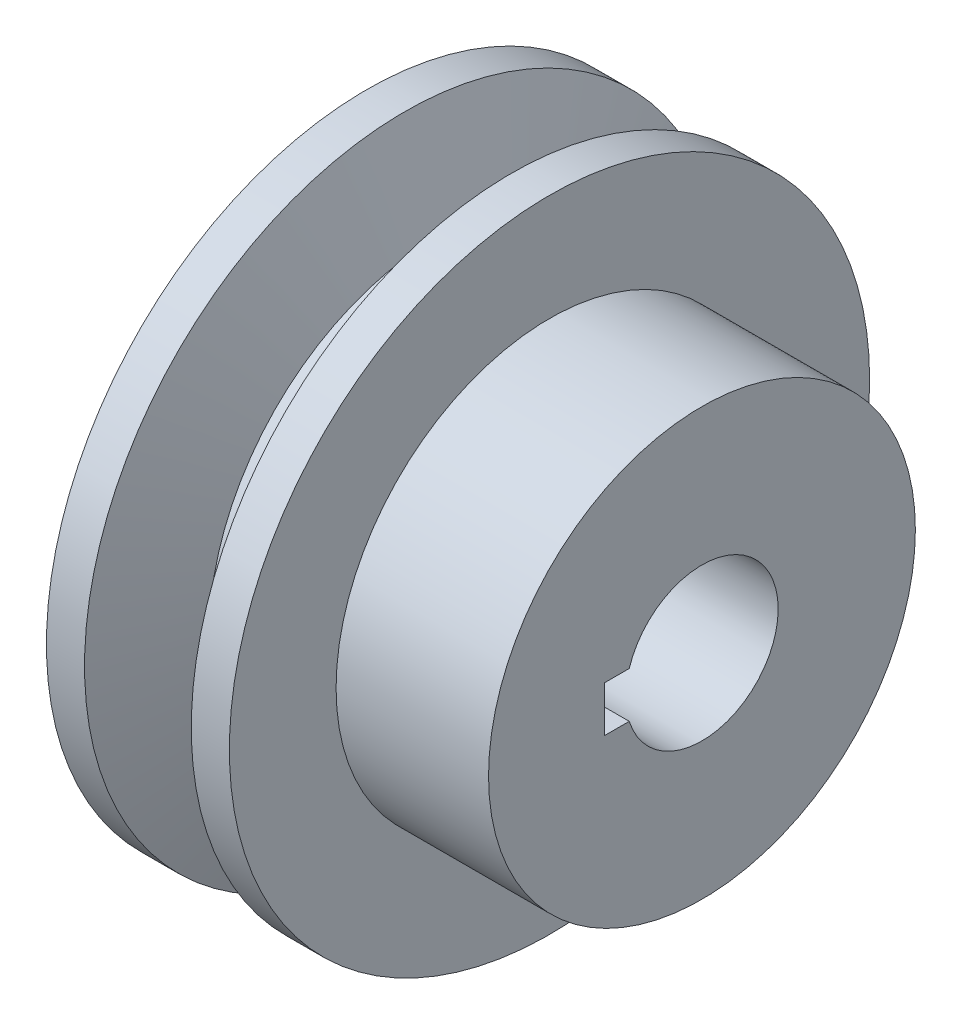
ISO-10303-21;
HEADER;
FILE_DESCRIPTION(('STEP AP214'),'2;1');
FILE_NAME('part.step','',(''),(''),'','','');
FILE_SCHEMA(('AUTOMOTIVE_DESIGN { 1 0 10303 214 1 1 1 1 }'));
ENDSEC;
DATA;
#1=APPLICATION_CONTEXT('core data for automotive mechanical design processes');
#2=APPLICATION_PROTOCOL_DEFINITION('international standard','automotive_design',2000,#1);
#3=PRODUCT_CONTEXT('',#1,'mechanical');
#4=PRODUCT('Part','Part','',(#3));
#5=PRODUCT_RELATED_PRODUCT_CATEGORY('part','',(#4));
#6=PRODUCT_DEFINITION_FORMATION('','',#4);
#7=PRODUCT_DEFINITION_CONTEXT('part definition',#1,'design');
#8=PRODUCT_DEFINITION('design','',#6,#7);
#9=PRODUCT_DEFINITION_SHAPE('','',#8);
#10=(LENGTH_UNIT() NAMED_UNIT(*) SI_UNIT(.MILLI.,.METRE.));
#11=(NAMED_UNIT(*) PLANE_ANGLE_UNIT() SI_UNIT($,.RADIAN.));
#12=(NAMED_UNIT(*) SI_UNIT($,.STERADIAN.) SOLID_ANGLE_UNIT());
#13=UNCERTAINTY_MEASURE_WITH_UNIT(LENGTH_MEASURE(1.E-05),#10,'distance_accuracy_value','');
#14=(GEOMETRIC_REPRESENTATION_CONTEXT(3) GLOBAL_UNCERTAINTY_ASSIGNED_CONTEXT((#13)) GLOBAL_UNIT_ASSIGNED_CONTEXT((#10,
#11,#12)) REPRESENTATION_CONTEXT('',''));
#15=CARTESIAN_POINT('',(0.,0.,0.));
#16=DIRECTION('',(0.,0.,1.));
#17=DIRECTION('',(1.,0.,0.));
#18=AXIS2_PLACEMENT_3D('',#15,#16,#17);
#19=CARTESIAN_POINT('',(22.,14.,0.));
#20=DIRECTION('',(1.,0.,0.));
#21=DIRECTION('',(0.,0.,-1.));
#22=AXIS2_PLACEMENT_3D('',#19,#20,#21);
#23=PLANE('',#22);
#24=DIRECTION('',(0.,0.,-1.));
#25=VECTOR('',#24,1.);
#26=CARTESIAN_POINT('',(22.,1.5,6.4));
#27=LINE('',#26,#25);
#28=CARTESIAN_POINT('',(22.,1.5,6.4));
#29=VERTEX_POINT('',#28);
#30=CARTESIAN_POINT('',(22.,1.5,4.76969600708473));
#31=VERTEX_POINT('',#30);
#32=EDGE_CURVE('E82',#29,#31,#27,.T.);
#33=ORIENTED_EDGE('',*,*,#32,.T.);
#34=CARTESIAN_POINT('',(22.,0.,0.));
#35=DIRECTION('',(-1.,0.,0.));
#36=DIRECTION('',(0.,0.,1.));
#37=AXIS2_PLACEMENT_3D('',#34,#35,#36);
#38=CIRCLE('',#37,5.);
#39=CARTESIAN_POINT('',(22.,-1.5,4.76969600708473));
#40=VERTEX_POINT('',#39);
#41=EDGE_CURVE('E92',#31,#40,#38,.T.);
#42=ORIENTED_EDGE('',*,*,#41,.T.);
#43=DIRECTION('',(0.,0.,1.));
#44=VECTOR('',#43,1.);
#45=CARTESIAN_POINT('',(22.,-1.5,6.4));
#46=LINE('',#45,#44);
#47=CARTESIAN_POINT('',(22.,-1.5,6.4));
#48=VERTEX_POINT('',#47);
#49=EDGE_CURVE('E54',#40,#48,#46,.T.);
#50=ORIENTED_EDGE('',*,*,#49,.T.);
#51=DIRECTION('',(0.,1.,0.));
#52=VECTOR('',#51,1.);
#53=CARTESIAN_POINT('',(22.,1.5,6.4));
#54=LINE('',#53,#52);
#55=EDGE_CURVE('E89',#48,#29,#54,.T.);
#56=ORIENTED_EDGE('',*,*,#55,.T.);
#57=EDGE_LOOP('',(#33,#42,#50,#56));
#58=FACE_BOUND('',#57,.T.);
#59=CARTESIAN_POINT('',(22.,0.,0.));
#60=DIRECTION('',(1.,0.,0.));
#61=DIRECTION('',(0.,0.,-1.));
#62=AXIS2_PLACEMENT_3D('',#59,#60,#61);
#63=CIRCLE('',#62,14.);
#64=CARTESIAN_POINT('',(22.,0.,-14.));
#65=VERTEX_POINT('',#64);
#66=EDGE_CURVE('E122',#65,#65,#63,.T.);
#67=ORIENTED_EDGE('',*,*,#66,.T.);
#68=EDGE_LOOP('',(#67));
#69=FACE_BOUND('',#68,.T.);
#70=ADVANCED_FACE('F39',(#58,#69),#23,.T.);
#71=CARTESIAN_POINT('',(0.,0.,0.));
#72=DIRECTION('',(-1.,0.,0.));
#73=DIRECTION('',(0.,0.,1.));
#74=AXIS2_PLACEMENT_3D('',#71,#72,#73);
#75=PLANE('',#74);
#76=DIRECTION('',(0.,0.,-1.));
#77=VECTOR('',#76,1.);
#78=CARTESIAN_POINT('',(0.,1.5,6.4));
#79=LINE('',#78,#77);
#80=CARTESIAN_POINT('',(0.,1.5,6.4));
#81=VERTEX_POINT('',#80);
#82=CARTESIAN_POINT('',(0.,1.5,4.76969600708473));
#83=VERTEX_POINT('',#82);
#84=EDGE_CURVE('E62',#81,#83,#79,.T.);
#85=ORIENTED_EDGE('',*,*,#84,.F.);
#86=DIRECTION('',(0.,1.,0.));
#87=VECTOR('',#86,1.);
#88=CARTESIAN_POINT('',(0.,1.5,6.4));
#89=LINE('',#88,#87);
#90=CARTESIAN_POINT('',(0.,-1.5,6.4));
#91=VERTEX_POINT('',#90);
#92=EDGE_CURVE('E100',#91,#81,#89,.T.);
#93=ORIENTED_EDGE('',*,*,#92,.F.);
#94=DIRECTION('',(0.,0.,1.));
#95=VECTOR('',#94,1.);
#96=CARTESIAN_POINT('',(0.,-1.5,6.4));
#97=LINE('',#96,#95);
#98=CARTESIAN_POINT('',(0.,-1.5,4.76969600708473));
#99=VERTEX_POINT('',#98);
#100=EDGE_CURVE('E104',#99,#91,#97,.T.);
#101=ORIENTED_EDGE('',*,*,#100,.F.);
#102=CARTESIAN_POINT('',(0.,0.,0.));
#103=DIRECTION('',(-1.,0.,0.));
#104=DIRECTION('',(0.,0.,1.));
#105=AXIS2_PLACEMENT_3D('',#102,#103,#104);
#106=CIRCLE('',#105,5.);
#107=EDGE_CURVE('E113',#83,#99,#106,.T.);
#108=ORIENTED_EDGE('',*,*,#107,.F.);
#109=EDGE_LOOP('',(#85,#93,#101,#108));
#110=FACE_BOUND('',#109,.T.);
#111=CARTESIAN_POINT('',(0.,0.,0.));
#112=DIRECTION('',(1.,0.,0.));
#113=DIRECTION('',(0.,0.,-1.));
#114=AXIS2_PLACEMENT_3D('',#111,#112,#113);
#115=CIRCLE('',#114,21.);
#116=CARTESIAN_POINT('',(0.,0.,-21.));
#117=VERTEX_POINT('',#116);
#118=EDGE_CURVE('E11',#117,#117,#115,.T.);
#119=ORIENTED_EDGE('',*,*,#118,.F.);
#120=EDGE_LOOP('',(#119));
#121=FACE_BOUND('',#120,.T.);
#122=ADVANCED_FACE('F159',(#110,#121),#75,.T.);
#123=CARTESIAN_POINT('',(22.,0.,0.));
#124=DIRECTION('',(1.,0.,0.));
#125=DIRECTION('',(0.,0.,-1.));
#126=AXIS2_PLACEMENT_3D('',#123,#124,#125);
#127=CYLINDRICAL_SURFACE('',#126,21.);
#128=ORIENTED_EDGE('',*,*,#118,.T.);
#129=EDGE_LOOP('',(#128));
#130=FACE_BOUND('',#129,.T.);
#131=CARTESIAN_POINT('',(2.5,0.,0.));
#132=DIRECTION('',(1.,0.,0.));
#133=DIRECTION('',(0.,0.,-1.));
#134=AXIS2_PLACEMENT_3D('',#131,#132,#133);
#135=CIRCLE('',#134,21.);
#136=CARTESIAN_POINT('',(2.5,0.,-21.));
#137=VERTEX_POINT('',#136);
#138=EDGE_CURVE('E47',#137,#137,#135,.T.);
#139=ORIENTED_EDGE('',*,*,#138,.F.);
#140=EDGE_LOOP('',(#139));
#141=FACE_BOUND('',#140,.T.);
#142=ADVANCED_FACE('F157',(#130,#141),#127,.T.);
#143=CARTESIAN_POINT('',(4.6838214055972,0.,0.));
#144=DIRECTION('',(-1.,0.,0.));
#145=DIRECTION('',(0.,0.,1.));
#146=AXIS2_PLACEMENT_3D('',#143,#144,#145);
#147=CONICAL_SURFACE('',#146,15.,1.22173047639603);
#148=ORIENTED_EDGE('',*,*,#138,.T.);
#149=EDGE_LOOP('',(#148));
#150=FACE_BOUND('',#149,.T.);
#151=CARTESIAN_POINT('',(4.6838214055972,0.,0.));
#152=DIRECTION('',(1.,0.,0.));
#153=DIRECTION('',(0.,0.,-1.));
#154=AXIS2_PLACEMENT_3D('',#151,#152,#153);
#155=CIRCLE('',#154,15.);
#156=CARTESIAN_POINT('',(4.6838214055972,0.,-15.));
#157=VERTEX_POINT('',#156);
#158=EDGE_CURVE('E147',#157,#157,#155,.T.);
#159=ORIENTED_EDGE('',*,*,#158,.F.);
#160=EDGE_LOOP('',(#159));
#161=FACE_BOUND('',#160,.T.);
#162=ADVANCED_FACE('F154',(#150,#161),#147,.T.);
#163=CARTESIAN_POINT('',(22.,0.,0.));
#164=DIRECTION('',(1.,0.,0.));
#165=DIRECTION('',(0.,0.,-1.));
#166=AXIS2_PLACEMENT_3D('',#163,#164,#165);
#167=CYLINDRICAL_SURFACE('',#166,15.);
#168=ORIENTED_EDGE('',*,*,#158,.T.);
#169=EDGE_LOOP('',(#168));
#170=FACE_BOUND('',#169,.T.);
#171=CARTESIAN_POINT('',(7.3161785944028,0.,0.));
#172=DIRECTION('',(1.,0.,0.));
#173=DIRECTION('',(0.,0.,-1.));
#174=AXIS2_PLACEMENT_3D('',#171,#172,#173);
#175=CIRCLE('',#174,15.);
#176=CARTESIAN_POINT('',(7.3161785944028,0.,-15.));
#177=VERTEX_POINT('',#176);
#178=EDGE_CURVE('E143',#177,#177,#175,.T.);
#179=ORIENTED_EDGE('',*,*,#178,.F.);
#180=EDGE_LOOP('',(#179));
#181=FACE_BOUND('',#180,.T.);
#182=ADVANCED_FACE('F166',(#170,#181),#167,.T.);
#183=CARTESIAN_POINT('',(9.5,0.,0.));
#184=DIRECTION('',(1.,0.,0.));
#185=DIRECTION('',(0.,0.,-1.));
#186=AXIS2_PLACEMENT_3D('',#183,#184,#185);
#187=CONICAL_SURFACE('',#186,21.,1.22173047639603);
#188=ORIENTED_EDGE('',*,*,#178,.T.);
#189=EDGE_LOOP('',(#188));
#190=FACE_BOUND('',#189,.T.);
#191=CARTESIAN_POINT('',(9.5,0.,0.));
#192=DIRECTION('',(1.,0.,0.));
#193=DIRECTION('',(0.,0.,-1.));
#194=AXIS2_PLACEMENT_3D('',#191,#192,#193);
#195=CIRCLE('',#194,21.);
#196=CARTESIAN_POINT('',(9.5,0.,-21.));
#197=VERTEX_POINT('',#196);
#198=EDGE_CURVE('E139',#197,#197,#195,.T.);
#199=ORIENTED_EDGE('',*,*,#198,.F.);
#200=EDGE_LOOP('',(#199));
#201=FACE_BOUND('',#200,.T.);
#202=ADVANCED_FACE('F230',(#190,#201),#187,.T.);
#203=CARTESIAN_POINT('',(22.,0.,0.));
#204=DIRECTION('',(1.,0.,0.));
#205=DIRECTION('',(0.,0.,-1.));
#206=AXIS2_PLACEMENT_3D('',#203,#204,#205);
#207=CYLINDRICAL_SURFACE('',#206,21.);
#208=ORIENTED_EDGE('',*,*,#198,.T.);
#209=EDGE_LOOP('',(#208));
#210=FACE_BOUND('',#209,.T.);
#211=CARTESIAN_POINT('',(12.,0.,0.));
#212=DIRECTION('',(1.,0.,0.));
#213=DIRECTION('',(0.,0.,-1.));
#214=AXIS2_PLACEMENT_3D('',#211,#212,#213);
#215=CIRCLE('',#214,21.);
#216=CARTESIAN_POINT('',(12.,0.,-21.));
#217=VERTEX_POINT('',#216);
#218=EDGE_CURVE('E135',#217,#217,#215,.T.);
#219=ORIENTED_EDGE('',*,*,#218,.F.);
#220=EDGE_LOOP('',(#219));
#221=FACE_BOUND('',#220,.T.);
#222=ADVANCED_FACE('F226',(#210,#221),#207,.T.);
#223=CARTESIAN_POINT('',(12.,21.,0.));
#224=DIRECTION('',(1.,0.,0.));
#225=DIRECTION('',(0.,0.,-1.));
#226=AXIS2_PLACEMENT_3D('',#223,#224,#225);
#227=PLANE('',#226);
#228=ORIENTED_EDGE('',*,*,#218,.T.);
#229=EDGE_LOOP('',(#228));
#230=FACE_BOUND('',#229,.T.);
#231=CARTESIAN_POINT('',(12.,0.,0.));
#232=DIRECTION('',(1.,0.,0.));
#233=DIRECTION('',(0.,0.,-1.));
#234=AXIS2_PLACEMENT_3D('',#231,#232,#233);
#235=CIRCLE('',#234,14.);
#236=CARTESIAN_POINT('',(12.,0.,-14.));
#237=VERTEX_POINT('',#236);
#238=EDGE_CURVE('E131',#237,#237,#235,.T.);
#239=ORIENTED_EDGE('',*,*,#238,.F.);
#240=EDGE_LOOP('',(#239));
#241=FACE_BOUND('',#240,.T.);
#242=ADVANCED_FACE('F222',(#230,#241),#227,.T.);
#243=CARTESIAN_POINT('',(22.,0.,0.));
#244=DIRECTION('',(1.,0.,0.));
#245=DIRECTION('',(0.,0.,-1.));
#246=AXIS2_PLACEMENT_3D('',#243,#244,#245);
#247=CYLINDRICAL_SURFACE('',#246,14.);
#248=ORIENTED_EDGE('',*,*,#238,.T.);
#249=EDGE_LOOP('',(#248));
#250=FACE_BOUND('',#249,.T.);
#251=ORIENTED_EDGE('',*,*,#66,.F.);
#252=EDGE_LOOP('',(#251));
#253=FACE_BOUND('',#252,.T.);
#254=ADVANCED_FACE('F188',(#250,#253),#247,.T.);
#255=CARTESIAN_POINT('',(22.,1.5,6.4));
#256=DIRECTION('',(0.,1.,0.));
#257=DIRECTION('',(0.,0.,1.));
#258=AXIS2_PLACEMENT_3D('',#255,#256,#257);
#259=PLANE('',#258);
#260=ORIENTED_EDGE('',*,*,#84,.T.);
#261=DIRECTION('',(-1.,0.,0.));
#262=VECTOR('',#261,1.);
#263=CARTESIAN_POINT('',(22.,1.5,4.76969600708473));
#264=LINE('',#263,#262);
#265=EDGE_CURVE('E78',#31,#83,#264,.T.);
#266=ORIENTED_EDGE('',*,*,#265,.F.);
#267=ORIENTED_EDGE('',*,*,#32,.F.);
#268=DIRECTION('',(-1.,0.,0.));
#269=VECTOR('',#268,1.);
#270=CARTESIAN_POINT('',(22.,1.5,6.4));
#271=LINE('',#270,#269);
#272=EDGE_CURVE('E119',#29,#81,#271,.T.);
#273=ORIENTED_EDGE('',*,*,#272,.T.);
#274=EDGE_LOOP('',(#260,#266,#267,#273));
#275=FACE_BOUND('',#274,.T.);
#276=ADVANCED_FACE('F80',(#275),#259,.F.);
#277=CARTESIAN_POINT('',(22.,1.5,6.4));
#278=DIRECTION('',(0.,0.,1.));
#279=DIRECTION('',(0.,-1.,0.));
#280=AXIS2_PLACEMENT_3D('',#277,#278,#279);
#281=PLANE('',#280);
#282=ORIENTED_EDGE('',*,*,#92,.T.);
#283=ORIENTED_EDGE('',*,*,#272,.F.);
#284=ORIENTED_EDGE('',*,*,#55,.F.);
#285=DIRECTION('',(-1.,0.,0.));
#286=VECTOR('',#285,1.);
#287=CARTESIAN_POINT('',(22.,-1.5,6.4));
#288=LINE('',#287,#286);
#289=EDGE_CURVE('E123',#48,#91,#288,.T.);
#290=ORIENTED_EDGE('',*,*,#289,.T.);
#291=EDGE_LOOP('',(#282,#283,#284,#290));
#292=FACE_BOUND('',#291,.T.);
#293=ADVANCED_FACE('F187',(#292),#281,.F.);
#294=CARTESIAN_POINT('',(22.,-1.5,6.4));
#295=DIRECTION('',(0.,-1.,0.));
#296=DIRECTION('',(0.,0.,-1.));
#297=AXIS2_PLACEMENT_3D('',#294,#295,#296);
#298=PLANE('',#297);
#299=ORIENTED_EDGE('',*,*,#100,.T.);
#300=ORIENTED_EDGE('',*,*,#289,.F.);
#301=ORIENTED_EDGE('',*,*,#49,.F.);
#302=DIRECTION('',(-1.,0.,0.));
#303=VECTOR('',#302,1.);
#304=CARTESIAN_POINT('',(22.,-1.5,4.76969600708473));
#305=LINE('',#304,#303);
#306=EDGE_CURVE('E88',#40,#99,#305,.T.);
#307=ORIENTED_EDGE('',*,*,#306,.T.);
#308=EDGE_LOOP('',(#299,#300,#301,#307));
#309=FACE_BOUND('',#308,.T.);
#310=ADVANCED_FACE('F199',(#309),#298,.F.);
#311=CARTESIAN_POINT('',(22.,0.,0.));
#312=DIRECTION('',(-1.,0.,0.));
#313=DIRECTION('',(0.,0.,1.));
#314=AXIS2_PLACEMENT_3D('',#311,#312,#313);
#315=CYLINDRICAL_SURFACE('',#314,5.);
#316=ORIENTED_EDGE('',*,*,#107,.T.);
#317=ORIENTED_EDGE('',*,*,#306,.F.);
#318=ORIENTED_EDGE('',*,*,#41,.F.);
#319=ORIENTED_EDGE('',*,*,#265,.T.);
#320=EDGE_LOOP('',(#316,#317,#318,#319));
#321=FACE_BOUND('',#320,.T.);
#322=ADVANCED_FACE('F93',(#321),#315,.F.);
#323=CLOSED_SHELL('',(#70,#122,#142,#162,#182,#202,#222,#242,#254,#276,#293,#310,#322));
#324=MANIFOLD_SOLID_BREP('B2',#323);
#325=ADVANCED_BREP_SHAPE_REPRESENTATION('',(#18,#324),#14);
#326=SHAPE_DEFINITION_REPRESENTATION(#9,#325);
ENDSEC;
END-ISO-10303-21;
